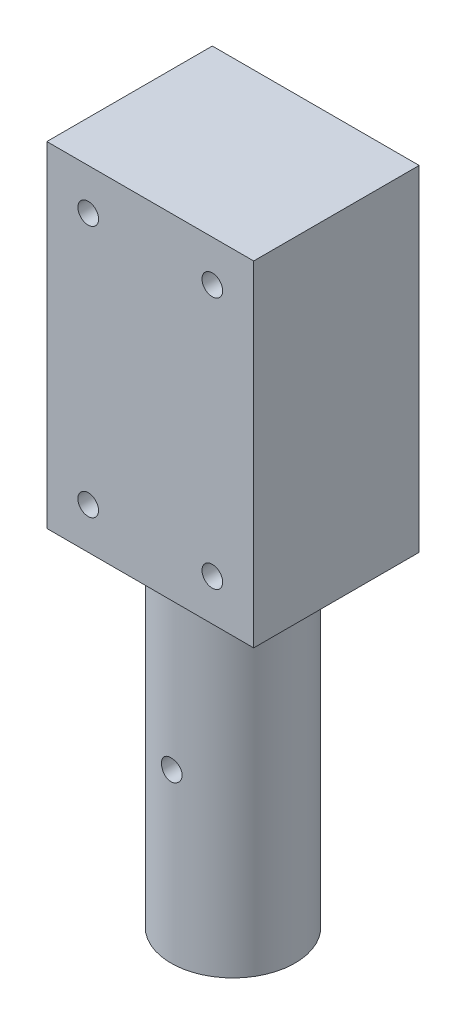
ISO-10303-21;
HEADER;
FILE_DESCRIPTION(('STEP AP214'),'2;1');
FILE_NAME('part.step','',(''),(''),'','','');
FILE_SCHEMA(('AUTOMOTIVE_DESIGN { 1 0 10303 214 1 1 1 1 }'));
ENDSEC;
DATA;
#1=APPLICATION_CONTEXT('core data for automotive mechanical design processes');
#2=APPLICATION_PROTOCOL_DEFINITION('international standard','automotive_design',2000,#1);
#3=PRODUCT_CONTEXT('',#1,'mechanical');
#4=PRODUCT('Part','Part','',(#3));
#5=PRODUCT_RELATED_PRODUCT_CATEGORY('part','',(#4));
#6=PRODUCT_DEFINITION_FORMATION('','',#4);
#7=PRODUCT_DEFINITION_CONTEXT('part definition',#1,'design');
#8=PRODUCT_DEFINITION('design','',#6,#7);
#9=PRODUCT_DEFINITION_SHAPE('','',#8);
#10=(LENGTH_UNIT() NAMED_UNIT(*) SI_UNIT(.MILLI.,.METRE.));
#11=(NAMED_UNIT(*) PLANE_ANGLE_UNIT() SI_UNIT($,.RADIAN.));
#12=(NAMED_UNIT(*) SI_UNIT($,.STERADIAN.) SOLID_ANGLE_UNIT());
#13=UNCERTAINTY_MEASURE_WITH_UNIT(LENGTH_MEASURE(1.E-05),#10,'distance_accuracy_value','');
#14=(GEOMETRIC_REPRESENTATION_CONTEXT(3) GLOBAL_UNCERTAINTY_ASSIGNED_CONTEXT((#13)) GLOBAL_UNIT_ASSIGNED_CONTEXT((#10,
#11,#12)) REPRESENTATION_CONTEXT('',''));
#15=CARTESIAN_POINT('',(0.,0.,0.));
#16=DIRECTION('',(0.,0.,1.));
#17=DIRECTION('',(1.,0.,0.));
#18=AXIS2_PLACEMENT_3D('',#15,#16,#17);
#19=CARTESIAN_POINT('',(0.,81.,0.));
#20=DIRECTION('',(1.,0.,0.));
#21=DIRECTION('',(0.,0.,-1.));
#22=AXIS2_PLACEMENT_3D('',#19,#20,#21);
#23=PLANE('',#22);
#24=DIRECTION('',(0.,0.,1.));
#25=VECTOR('',#24,1.);
#26=CARTESIAN_POINT('',(0.,0.,0.));
#27=LINE('',#26,#25);
#28=CARTESIAN_POINT('',(0.,0.,-40.));
#29=VERTEX_POINT('',#28);
#30=CARTESIAN_POINT('',(0.,0.,0.));
#31=VERTEX_POINT('',#30);
#32=EDGE_CURVE('E183',#29,#31,#27,.T.);
#33=ORIENTED_EDGE('',*,*,#32,.T.);
#34=DIRECTION('',(0.,-1.,0.));
#35=VECTOR('',#34,1.);
#36=CARTESIAN_POINT('',(0.,81.,0.));
#37=LINE('',#36,#35);
#38=CARTESIAN_POINT('',(0.,81.,0.));
#39=VERTEX_POINT('',#38);
#40=EDGE_CURVE('E57',#39,#31,#37,.T.);
#41=ORIENTED_EDGE('',*,*,#40,.F.);
#42=DIRECTION('',(0.,0.,1.));
#43=VECTOR('',#42,1.);
#44=CARTESIAN_POINT('',(0.,81.,0.));
#45=LINE('',#44,#43);
#46=CARTESIAN_POINT('',(0.,81.,-40.));
#47=VERTEX_POINT('',#46);
#48=EDGE_CURVE('E185',#47,#39,#45,.T.);
#49=ORIENTED_EDGE('',*,*,#48,.F.);
#50=DIRECTION('',(0.,-1.,0.));
#51=VECTOR('',#50,1.);
#52=CARTESIAN_POINT('',(0.,81.,-40.));
#53=LINE('',#52,#51);
#54=EDGE_CURVE('E191',#47,#29,#53,.T.);
#55=ORIENTED_EDGE('',*,*,#54,.T.);
#56=EDGE_LOOP('',(#33,#41,#49,#55));
#57=FACE_BOUND('',#56,.T.);
#58=ADVANCED_FACE('F43',(#57),#23,.F.);
#59=CARTESIAN_POINT('',(0.,81.,0.));
#60=DIRECTION('',(0.,0.,-1.));
#61=DIRECTION('',(-1.,0.,0.));
#62=AXIS2_PLACEMENT_3D('',#59,#60,#61);
#63=PLANE('',#62);
#64=CARTESIAN_POINT('',(10.,10.,0.));
#65=DIRECTION('',(0.,0.,1.));
#66=DIRECTION('',(1.,0.,0.));
#67=AXIS2_PLACEMENT_3D('',#64,#65,#66);
#68=CIRCLE('',#67,2.5);
#69=CARTESIAN_POINT('',(12.5,10.,0.));
#70=VERTEX_POINT('',#69);
#71=EDGE_CURVE('E156',#70,#70,#68,.T.);
#72=ORIENTED_EDGE('',*,*,#71,.F.);
#73=EDGE_LOOP('',(#72));
#74=FACE_BOUND('',#73,.T.);
#75=CARTESIAN_POINT('',(40.,10.,0.));
#76=DIRECTION('',(0.,0.,1.));
#77=DIRECTION('',(1.,0.,0.));
#78=AXIS2_PLACEMENT_3D('',#75,#76,#77);
#79=CIRCLE('',#78,2.5);
#80=CARTESIAN_POINT('',(42.5,10.,0.));
#81=VERTEX_POINT('',#80);
#82=EDGE_CURVE('E162',#81,#81,#79,.T.);
#83=ORIENTED_EDGE('',*,*,#82,.F.);
#84=EDGE_LOOP('',(#83));
#85=FACE_BOUND('',#84,.T.);
#86=CARTESIAN_POINT('',(40.,71.,0.));
#87=DIRECTION('',(0.,0.,1.));
#88=DIRECTION('',(1.,0.,0.));
#89=AXIS2_PLACEMENT_3D('',#86,#87,#88);
#90=CIRCLE('',#89,2.5);
#91=CARTESIAN_POINT('',(42.5,71.,0.));
#92=VERTEX_POINT('',#91);
#93=EDGE_CURVE('E168',#92,#92,#90,.T.);
#94=ORIENTED_EDGE('',*,*,#93,.F.);
#95=EDGE_LOOP('',(#94));
#96=FACE_BOUND('',#95,.T.);
#97=CARTESIAN_POINT('',(10.,71.,0.));
#98=DIRECTION('',(0.,0.,1.));
#99=DIRECTION('',(1.,0.,0.));
#100=AXIS2_PLACEMENT_3D('',#97,#98,#99);
#101=CIRCLE('',#100,2.5);
#102=CARTESIAN_POINT('',(12.5,71.,0.));
#103=VERTEX_POINT('',#102);
#104=EDGE_CURVE('E174',#103,#103,#101,.T.);
#105=ORIENTED_EDGE('',*,*,#104,.F.);
#106=EDGE_LOOP('',(#105));
#107=FACE_BOUND('',#106,.T.);
#108=DIRECTION('',(1.,0.,0.));
#109=VECTOR('',#108,1.);
#110=CARTESIAN_POINT('',(0.,0.,0.));
#111=LINE('',#110,#109);
#112=CARTESIAN_POINT('',(50.,0.,0.));
#113=VERTEX_POINT('',#112);
#114=EDGE_CURVE('E194',#31,#113,#111,.T.);
#115=ORIENTED_EDGE('',*,*,#114,.T.);
#116=DIRECTION('',(0.,-1.,0.));
#117=VECTOR('',#116,1.);
#118=CARTESIAN_POINT('',(50.,81.,0.));
#119=LINE('',#118,#117);
#120=CARTESIAN_POINT('',(50.,81.,0.));
#121=VERTEX_POINT('',#120);
#122=EDGE_CURVE('E201',#121,#113,#119,.T.);
#123=ORIENTED_EDGE('',*,*,#122,.F.);
#124=DIRECTION('',(1.,0.,0.));
#125=VECTOR('',#124,1.);
#126=CARTESIAN_POINT('',(0.,81.,0.));
#127=LINE('',#126,#125);
#128=EDGE_CURVE('E98',#39,#121,#127,.T.);
#129=ORIENTED_EDGE('',*,*,#128,.F.);
#130=ORIENTED_EDGE('',*,*,#40,.T.);
#131=EDGE_LOOP('',(#115,#123,#129,#130));
#132=FACE_BOUND('',#131,.T.);
#133=ADVANCED_FACE('F228',(#74,#85,#96,#107,#132),#63,.F.);
#134=CARTESIAN_POINT('',(50.,81.,0.));
#135=DIRECTION('',(-1.,0.,0.));
#136=DIRECTION('',(0.,0.,1.));
#137=AXIS2_PLACEMENT_3D('',#134,#135,#136);
#138=PLANE('',#137);
#139=DIRECTION('',(0.,0.,-1.));
#140=VECTOR('',#139,1.);
#141=CARTESIAN_POINT('',(50.,0.,0.));
#142=LINE('',#141,#140);
#143=CARTESIAN_POINT('',(50.,0.,-40.));
#144=VERTEX_POINT('',#143);
#145=EDGE_CURVE('E84',#113,#144,#142,.T.);
#146=ORIENTED_EDGE('',*,*,#145,.T.);
#147=DIRECTION('',(0.,-1.,0.));
#148=VECTOR('',#147,1.);
#149=CARTESIAN_POINT('',(50.,81.,-40.));
#150=LINE('',#149,#148);
#151=CARTESIAN_POINT('',(50.,81.,-40.));
#152=VERTEX_POINT('',#151);
#153=EDGE_CURVE('E199',#152,#144,#150,.T.);
#154=ORIENTED_EDGE('',*,*,#153,.F.);
#155=DIRECTION('',(0.,0.,-1.));
#156=VECTOR('',#155,1.);
#157=CARTESIAN_POINT('',(50.,81.,0.));
#158=LINE('',#157,#156);
#159=EDGE_CURVE('E188',#121,#152,#158,.T.);
#160=ORIENTED_EDGE('',*,*,#159,.F.);
#161=ORIENTED_EDGE('',*,*,#122,.T.);
#162=EDGE_LOOP('',(#146,#154,#160,#161));
#163=FACE_BOUND('',#162,.T.);
#164=ADVANCED_FACE('F233',(#163),#138,.F.);
#165=CARTESIAN_POINT('',(0.,81.,-40.));
#166=DIRECTION('',(0.,0.,1.));
#167=DIRECTION('',(1.,0.,0.));
#168=AXIS2_PLACEMENT_3D('',#165,#166,#167);
#169=PLANE('',#168);
#170=CARTESIAN_POINT('',(40.,10.,-40.));
#171=DIRECTION('',(0.,0.,-1.));
#172=DIRECTION('',(-1.,0.,0.));
#173=AXIS2_PLACEMENT_3D('',#170,#171,#172);
#174=CIRCLE('',#173,2.5);
#175=CARTESIAN_POINT('',(37.5,10.,-40.));
#176=VERTEX_POINT('',#175);
#177=EDGE_CURVE('E134',#176,#176,#174,.T.);
#178=ORIENTED_EDGE('',*,*,#177,.F.);
#179=EDGE_LOOP('',(#178));
#180=FACE_BOUND('',#179,.T.);
#181=CARTESIAN_POINT('',(10.,10.,-40.));
#182=DIRECTION('',(0.,0.,-1.));
#183=DIRECTION('',(-1.,0.,0.));
#184=AXIS2_PLACEMENT_3D('',#181,#182,#183);
#185=CIRCLE('',#184,2.5);
#186=CARTESIAN_POINT('',(7.50000000000001,10.,-40.));
#187=VERTEX_POINT('',#186);
#188=EDGE_CURVE('E133',#187,#187,#185,.T.);
#189=ORIENTED_EDGE('',*,*,#188,.F.);
#190=EDGE_LOOP('',(#189));
#191=FACE_BOUND('',#190,.T.);
#192=CARTESIAN_POINT('',(10.,71.,-40.));
#193=DIRECTION('',(0.,0.,-1.));
#194=DIRECTION('',(-1.,0.,0.));
#195=AXIS2_PLACEMENT_3D('',#192,#193,#194);
#196=CIRCLE('',#195,2.5);
#197=CARTESIAN_POINT('',(7.50000000000001,71.,-40.));
#198=VERTEX_POINT('',#197);
#199=EDGE_CURVE('E144',#198,#198,#196,.T.);
#200=ORIENTED_EDGE('',*,*,#199,.F.);
#201=EDGE_LOOP('',(#200));
#202=FACE_BOUND('',#201,.T.);
#203=CARTESIAN_POINT('',(40.,71.,-40.));
#204=DIRECTION('',(0.,0.,-1.));
#205=DIRECTION('',(-1.,0.,0.));
#206=AXIS2_PLACEMENT_3D('',#203,#204,#205);
#207=CIRCLE('',#206,2.5);
#208=CARTESIAN_POINT('',(37.5,71.,-40.));
#209=VERTEX_POINT('',#208);
#210=EDGE_CURVE('E150',#209,#209,#207,.T.);
#211=ORIENTED_EDGE('',*,*,#210,.F.);
#212=EDGE_LOOP('',(#211));
#213=FACE_BOUND('',#212,.T.);
#214=DIRECTION('',(-1.,0.,0.));
#215=VECTOR('',#214,1.);
#216=CARTESIAN_POINT('',(0.,0.,-40.));
#217=LINE('',#216,#215);
#218=EDGE_CURVE('E90',#144,#29,#217,.T.);
#219=ORIENTED_EDGE('',*,*,#218,.T.);
#220=ORIENTED_EDGE('',*,*,#54,.F.);
#221=DIRECTION('',(-1.,0.,0.));
#222=VECTOR('',#221,1.);
#223=CARTESIAN_POINT('',(0.,81.,-40.));
#224=LINE('',#223,#222);
#225=EDGE_CURVE('E66',#152,#47,#224,.T.);
#226=ORIENTED_EDGE('',*,*,#225,.F.);
#227=ORIENTED_EDGE('',*,*,#153,.T.);
#228=EDGE_LOOP('',(#219,#220,#226,#227));
#229=FACE_BOUND('',#228,.T.);
#230=ADVANCED_FACE('F242',(#180,#191,#202,#213,#229),#169,.F.);
#231=CARTESIAN_POINT('',(0.,81.,0.));
#232=DIRECTION('',(0.,-1.,0.));
#233=DIRECTION('',(0.,0.,-1.));
#234=AXIS2_PLACEMENT_3D('',#231,#232,#233);
#235=PLANE('',#234);
#236=ORIENTED_EDGE('',*,*,#48,.T.);
#237=ORIENTED_EDGE('',*,*,#128,.T.);
#238=ORIENTED_EDGE('',*,*,#159,.T.);
#239=ORIENTED_EDGE('',*,*,#225,.T.);
#240=EDGE_LOOP('',(#236,#237,#238,#239));
#241=FACE_BOUND('',#240,.T.);
#242=ADVANCED_FACE('F240',(#241),#235,.F.);
#243=CARTESIAN_POINT('',(0.,0.,0.));
#244=DIRECTION('',(0.,-1.,0.));
#245=DIRECTION('',(0.,0.,-1.));
#246=AXIS2_PLACEMENT_3D('',#243,#244,#245);
#247=PLANE('',#246);
#248=CARTESIAN_POINT('',(25.,0.,-20.));
#249=DIRECTION('',(0.,-1.,0.));
#250=DIRECTION('',(0.,0.,-1.));
#251=AXIS2_PLACEMENT_3D('',#248,#249,#250);
#252=CIRCLE('',#251,15.);
#253=CARTESIAN_POINT('',(25.,0.,-35.));
#254=VERTEX_POINT('',#253);
#255=EDGE_CURVE('E11',#254,#254,#252,.T.);
#256=ORIENTED_EDGE('',*,*,#255,.F.);
#257=EDGE_LOOP('',(#256));
#258=FACE_BOUND('',#257,.T.);
#259=ORIENTED_EDGE('',*,*,#32,.F.);
#260=ORIENTED_EDGE('',*,*,#218,.F.);
#261=ORIENTED_EDGE('',*,*,#145,.F.);
#262=ORIENTED_EDGE('',*,*,#114,.F.);
#263=EDGE_LOOP('',(#259,#260,#261,#262));
#264=FACE_BOUND('',#263,.T.);
#265=ADVANCED_FACE('F225',(#258,#264),#247,.T.);
#266=CARTESIAN_POINT('',(25.,-81.,-20.));
#267=DIRECTION('',(0.,1.,0.));
#268=DIRECTION('',(0.,0.,1.));
#269=AXIS2_PLACEMENT_3D('',#266,#267,#268);
#270=CYLINDRICAL_SURFACE('',#269,15.);
#271=CARTESIAN_POINT('',(25.,-43.,-5.00000000000001));
#272=CARTESIAN_POINT('',(24.8606090950418,-42.9999944110522,-5.00000238831177));
#273=CARTESIAN_POINT('',(24.7211421181612,-42.9883027250311,-5.00196322086967));
#274=CARTESIAN_POINT('',(24.446119778327,-42.9418643412347,-5.00959655058613));
#275=CARTESIAN_POINT('',(24.3105681320408,-42.9070964430884,-5.01527246076111));
#276=CARTESIAN_POINT('',(24.0473952527874,-42.8155845514072,-5.02969931763551));
#277=CARTESIAN_POINT('',(23.9197676315681,-42.7588585343594,-5.03844774840808));
#278=CARTESIAN_POINT('',(23.6758581580221,-42.6250877079476,-5.05805772917931));
#279=CARTESIAN_POINT('',(23.5595750101214,-42.548045222517,-5.06891903745567));
#280=CARTESIAN_POINT('',(23.3405273857083,-42.3750449161795,-5.09166682541688));
#281=CARTESIAN_POINT('',(23.237887096465,-42.2789308853639,-5.10356128185144));
#282=CARTESIAN_POINT('',(23.0501115013401,-42.0708520315272,-5.12697373123269));
#283=CARTESIAN_POINT('',(22.964977300609,-41.9588862085434,-5.13849170037333));
#284=CARTESIAN_POINT('',(22.8141328743949,-41.7214290338029,-5.1599243424022));
#285=CARTESIAN_POINT('',(22.748545447139,-41.5958586631953,-5.16982870908365));
#286=CARTESIAN_POINT('',(22.6394416345888,-41.3352904356994,-5.18680210205326));
#287=CARTESIAN_POINT('',(22.5959237584344,-41.2002932163224,-5.19387131985693));
#288=CARTESIAN_POINT('',(22.5325856222152,-40.9260197251435,-5.20429463157245));
#289=CARTESIAN_POINT('',(22.5125509708646,-40.7867942634986,-5.20768231514301));
#290=CARTESIAN_POINT('',(22.4960832747101,-40.5069197231165,-5.21046061063351));
#291=CARTESIAN_POINT('',(22.499648559611,-40.3662707458327,-5.20985150542787));
#292=CARTESIAN_POINT('',(22.5301049016038,-40.0890721387246,-5.20473571136446));
#293=CARTESIAN_POINT('',(22.5567551181102,-39.9524951964548,-5.20026926681084));
#294=CARTESIAN_POINT('',(22.6322468595966,-39.6857786821709,-5.18800504788993));
#295=CARTESIAN_POINT('',(22.6810891456803,-39.5556393311115,-5.18020715926729));
#296=CARTESIAN_POINT('',(22.7998227539061,-39.3047711765591,-5.16211520665901));
#297=CARTESIAN_POINT('',(22.8698140861203,-39.1840905939188,-5.15180932892675));
#298=CARTESIAN_POINT('',(23.0287879824426,-38.9560955994616,-5.12987081584992));
#299=CARTESIAN_POINT('',(23.1177720793457,-38.8487822675451,-5.11823807345715));
#300=CARTESIAN_POINT('',(23.3135177878409,-38.6491739141927,-5.09477972120215));
#301=CARTESIAN_POINT('',(23.4204860361269,-38.5570814814599,-5.08295350768349));
#302=CARTESIAN_POINT('',(23.6484647510183,-38.3921222373347,-5.06057398603277));
#303=CARTESIAN_POINT('',(23.7694753080936,-38.3192555498168,-5.05002068610255));
#304=CARTESIAN_POINT('',(24.0222940838333,-38.1947977728637,-5.03136107107089));
#305=CARTESIAN_POINT('',(24.1541112744353,-38.1432245806687,-5.02325681592554));
#306=CARTESIAN_POINT('',(24.4247016543973,-38.063005784754,-5.01042496987341));
#307=CARTESIAN_POINT('',(24.5634742608205,-38.0343582630263,-5.00569709649527));
#308=CARTESIAN_POINT('',(24.8422900986984,-38.0010786415389,-5.00018870157314));
#309=CARTESIAN_POINT('',(24.982299262849,-37.9961684281944,-4.99936246987216));
#310=CARTESIAN_POINT('',(25.2611397728899,-38.0097613444281,-5.0016252557883));
#311=CARTESIAN_POINT('',(25.399971163892,-38.0282635731337,-5.00471412275882));
#312=CARTESIAN_POINT('',(25.6716561755468,-38.0879248493355,-5.01443173061798));
#313=CARTESIAN_POINT('',(25.8045408683854,-38.1289462083901,-5.0210389519869));
#314=CARTESIAN_POINT('',(26.0615468848604,-38.2323345181995,-5.03705535544642));
#315=CARTESIAN_POINT('',(26.1856677159097,-38.2947026676353,-5.04646469487981));
#316=CARTESIAN_POINT('',(26.422830689469,-38.4396511246968,-5.06715483697593));
#317=CARTESIAN_POINT('',(26.5357652509371,-38.5224051561673,-5.07845144112978));
#318=CARTESIAN_POINT('',(26.7462435855027,-38.7055373153851,-5.101615326081));
#319=CARTESIAN_POINT('',(26.8437862396966,-38.8059167232767,-5.11348264828454));
#320=CARTESIAN_POINT('',(27.021742779658,-39.0226975480714,-5.13659824764155));
#321=CARTESIAN_POINT('',(27.1019687611137,-39.1392541655144,-5.14783883862895));
#322=CARTESIAN_POINT('',(27.241702310295,-39.3843529691385,-5.16828470222116));
#323=CARTESIAN_POINT('',(27.3012105347698,-39.5128947752275,-5.17749003933981));
#324=CARTESIAN_POINT('',(27.3975383314732,-39.7777897328121,-5.19276546302296));
#325=CARTESIAN_POINT('',(27.4344514325479,-39.9141080950305,-5.19884845688936));
#326=CARTESIAN_POINT('',(27.4848354537783,-40.1911201292218,-5.2072228316474));
#327=CARTESIAN_POINT('',(27.4983084119462,-40.3318134197321,-5.20951454217279));
#328=CARTESIAN_POINT('',(27.5013728660474,-40.6117051659624,-5.21003266915989));
#329=CARTESIAN_POINT('',(27.4912601361252,-40.7509003785753,-5.20830943494351));
#330=CARTESIAN_POINT('',(27.4480798389568,-41.0255792480508,-5.20110218546272));
#331=CARTESIAN_POINT('',(27.4150123461125,-41.1610629169419,-5.19561818238787));
#332=CARTESIAN_POINT('',(27.3269744895949,-41.4243584372926,-5.18152643718282));
#333=CARTESIAN_POINT('',(27.2720295906004,-41.552179010056,-5.17292232780331));
#334=CARTESIAN_POINT('',(27.1418270039159,-41.7968356691948,-5.15355631077793));
#335=CARTESIAN_POINT('',(27.0665683087486,-41.9136712103721,-5.14279429611601));
#336=CARTESIAN_POINT('',(26.8968188843722,-42.1345355831078,-5.12016545954379));
#337=CARTESIAN_POINT('',(26.8021105635936,-42.2383960167003,-5.10828704423698));
#338=CARTESIAN_POINT('',(26.5966090313802,-42.4288516044749,-5.0848562763916));
#339=CARTESIAN_POINT('',(26.4858121129126,-42.5154427686382,-5.07330399973454));
#340=CARTESIAN_POINT('',(26.2503691696403,-42.6694482681999,-5.0517347035778));
#341=CARTESIAN_POINT('',(26.1256327875328,-42.7367260393129,-5.04172883746896));
#342=CARTESIAN_POINT('',(25.866513069379,-42.8492694846099,-5.02448832398225));
#343=CARTESIAN_POINT('',(25.73213949483,-42.8945570810797,-5.01725091822519));
#344=CARTESIAN_POINT('',(25.4977033100454,-42.9520052741267,-5.00794209167045));
#345=CARTESIAN_POINT('',(25.3990588302985,-42.969974469616,-5.00497972726642));
#346=CARTESIAN_POINT('',(25.2002893103198,-42.9939737378448,-5.0010078401388));
#347=CARTESIAN_POINT('',(25.1001642956085,-43.0000040161374,-4.99999828379359));
#348=CARTESIAN_POINT('',(25.,-43.,-5.00000000000001));
#349=B_SPLINE_CURVE_WITH_KNOTS('',3,(#271,#272,#273,#274,#275,#276,#277,#278,#279,#280,#281,
#282,#283,#284,#285,#286,#287,#288,#289,#290,#291,#292,#293,#294,#295,#296,#297,#298,#299,#300,
#301,#302,#303,#304,#305,#306,#307,#308,#309,#310,#311,#312,#313,#314,#315,#316,#317,#318,#319,
#320,#321,#322,#323,#324,#325,#326,#327,#328,#329,#330,#331,#332,#333,#334,#335,#336,#337,#338,
#339,#340,#341,#342,#343,#344,#345,#346,#347,#348),.UNSPECIFIED.,.T.,.F.,(4,2,2,2,2,2,2,2,2,2,2,
2,2,2,2,2,2,2,2,2,2,2,2,2,2,2,2,2,2,2,2,2,2,2,2,2,2,2,4),(0.,0.417806584938507,0.83599754569542,
1.25384686702527,1.67164841267479,2.09302491062332,2.51442800169857,2.9384252082384,
3.36239376876181,3.78246077103422,4.20249804320886,4.61820521760409,5.03392665025381,
5.45164556632558,5.86939820680573,6.29232769911326,6.71525991635847,7.13854688915903,
7.56179844521149,7.98007883491396,8.39834313035859,8.81407807006415,9.22983635826066,
9.64926825627023,10.0687306305428,10.4925382200762,10.9163323737594,11.3383602234177,
11.7603513778662,12.177079095227,12.5938054618813,13.0100481822622,13.4263115502934,
13.8475138419339,14.2688133387897,14.693022316072,15.1168075213007,15.4170424816402,
15.7172722727697),.UNSPECIFIED.);
#350=CARTESIAN_POINT('',(25.,-43.,-5.00000000000001));
#351=VERTEX_POINT('',#350);
#352=EDGE_CURVE('E46',#351,#351,#349,.T.);
#353=ORIENTED_EDGE('',*,*,#352,.T.);
#354=EDGE_LOOP('',(#353));
#355=FACE_BOUND('',#354,.T.);
#356=CARTESIAN_POINT('',(27.5,-40.5,-34.790199457749));
#357=CARTESIAN_POINT('',(27.4999943984198,-40.3606242518382,-34.790201973666));
#358=CARTESIAN_POINT('',(27.4883051690283,-40.2211723939285,-34.7921909238523));
#359=CARTESIAN_POINT('',(27.4418774280664,-39.9461814567368,-34.7999245720004));
#360=CARTESIAN_POINT('',(27.4071176603086,-39.8106461062419,-34.8056727334637));
#361=CARTESIAN_POINT('',(27.3156295436705,-39.5475077166584,-34.8202560936731));
#362=CARTESIAN_POINT('',(27.258919554932,-39.4198981513378,-34.8290887118401));
#363=CARTESIAN_POINT('',(27.1251864968895,-39.1760190452822,-34.8488427210228));
#364=CARTESIAN_POINT('',(27.0481657135013,-39.0597482304227,-34.8597638769423));
#365=CARTESIAN_POINT('',(26.8751875269665,-38.8406871502554,-34.8825847115588));
#366=CARTESIAN_POINT('',(26.7790690489323,-38.7380248686138,-34.8944921732795));
#367=CARTESIAN_POINT('',(26.5709720046953,-38.5502066931382,-34.9178748066858));
#368=CARTESIAN_POINT('',(26.45899249915,-38.4650518368846,-34.9293499527173));
#369=CARTESIAN_POINT('',(26.2215228699484,-38.3141854327807,-34.9506573698271));
#370=CARTESIAN_POINT('',(26.0959560814567,-38.2485929922682,-34.9604794243234));
#371=CARTESIAN_POINT('',(25.8353956217239,-38.1394789294694,-34.9772873695709));
#372=CARTESIAN_POINT('',(25.7004025640782,-38.0959558721151,-34.9842734447266));
#373=CARTESIAN_POINT('',(25.4261437263442,-38.0326074650161,-34.994567347244));
#374=CARTESIAN_POINT('',(25.2869288866793,-38.0125670839953,-34.9979085311091));
#375=CARTESIAN_POINT('',(25.0070752855258,-37.9960842458474,-35.0006507934278));
#376=CARTESIAN_POINT('',(24.8664366214711,-37.9996401847528,-35.0000521396931));
#377=CARTESIAN_POINT('',(24.5891978149211,-38.0300813515282,-34.9950085843139));
#378=CARTESIAN_POINT('',(24.4525714692999,-38.0567351634092,-34.990601836924));
#379=CARTESIAN_POINT('',(24.1857580203882,-38.1322510742465,-34.9784797877164));
#380=CARTESIAN_POINT('',(24.0555711133485,-38.1811138495895,-34.9707643851321));
#381=CARTESIAN_POINT('',(23.8046438522174,-38.2998906403153,-34.9528269851196));
#382=CARTESIAN_POINT('',(23.683949476981,-38.3699000120824,-34.9425936732688));
#383=CARTESIAN_POINT('',(23.4559344701534,-38.528912822635,-34.920757380715));
#384=CARTESIAN_POINT('',(23.3486149220841,-38.6179177987108,-34.9091542891913));
#385=CARTESIAN_POINT('',(23.1490287265533,-38.8136788066193,-34.885702682326));
#386=CARTESIAN_POINT('',(23.0569604977468,-38.920637094901,-34.8738528973104));
#387=CARTESIAN_POINT('',(22.8920454115519,-39.1485870902158,-34.8513795978481));
#388=CARTESIAN_POINT('',(22.8191987314676,-39.2695789266828,-34.8407560947132));
#389=CARTESIAN_POINT('',(22.6947555655117,-39.5223916418775,-34.8219375456182));
#390=CARTESIAN_POINT('',(22.6431829727208,-39.6542244980921,-34.813745233026));
#391=CARTESIAN_POINT('',(22.5629701291844,-39.9248490723075,-34.8007618868988));
#392=CARTESIAN_POINT('',(22.534327859232,-40.0636401764324,-34.7959705538832));
#393=CARTESIAN_POINT('',(22.5010681151207,-40.3424661561621,-34.7903895942212));
#394=CARTESIAN_POINT('',(22.4961677920876,-40.4824663797021,-34.7895528575867));
#395=CARTESIAN_POINT('',(22.5097772973175,-40.7612866716908,-34.7918503478236));
#396=CARTESIAN_POINT('',(22.5282862213753,-40.900106785514,-34.7949844213185));
#397=CARTESIAN_POINT('',(22.5879476650719,-41.1717277591909,-34.8048268745502));
#398=CARTESIAN_POINT('',(22.6289562093536,-41.304561139878,-34.8115125191835));
#399=CARTESIAN_POINT('',(22.7323018098077,-41.5614701662795,-34.827685730055));
#400=CARTESIAN_POINT('',(22.7946401418991,-41.6855452875509,-34.8371734639058));
#401=CARTESIAN_POINT('',(22.9395433267708,-41.9226745944061,-34.8579912839739));
#402=CARTESIAN_POINT('',(23.0222894358406,-42.0356165727561,-34.8693375560035));
#403=CARTESIAN_POINT('',(23.205410534292,-42.246113532695,-34.8925466667987));
#404=CARTESIAN_POINT('',(23.305786763616,-42.3436674311097,-34.9044095418533));
#405=CARTESIAN_POINT('',(23.5225719296712,-42.5216518927287,-34.9274642211826));
#406=CARTESIAN_POINT('',(23.6391367466138,-42.6018938262845,-34.9386477634467));
#407=CARTESIAN_POINT('',(23.8842565520507,-42.7416553270049,-34.9589511243294));
#408=CARTESIAN_POINT('',(24.0128111525294,-42.8011755644738,-34.9680710096998));
#409=CARTESIAN_POINT('',(24.2777009484987,-42.8975105839549,-34.9831835816958));
#410=CARTESIAN_POINT('',(24.4139994373974,-42.9344240757349,-34.9891898456762));
#411=CARTESIAN_POINT('',(24.6909692651258,-42.9848155989638,-34.9974558316928));
#412=CARTESIAN_POINT('',(24.8316402431784,-42.9982955587324,-34.9997158620019));
#413=CARTESIAN_POINT('',(25.1115412757737,-43.0013818823122,-35.0002303788781));
#414=CARTESIAN_POINT('',(25.2507681606027,-42.9912752539411,-34.9985330202419));
#415=CARTESIAN_POINT('',(25.5255119743147,-42.9480960777306,-34.9914217838733));
#416=CARTESIAN_POINT('',(25.6610289239675,-42.9150236584903,-34.9860079269518));
#417=CARTESIAN_POINT('',(25.9243964459185,-42.8269618344563,-34.972069888274));
#418=CARTESIAN_POINT('',(26.0522553721538,-42.7719968317899,-34.9635491704088));
#419=CARTESIAN_POINT('',(26.2969804529822,-42.6417420637694,-34.9443275687803));
#420=CARTESIAN_POINT('',(26.4138460861182,-42.5664513349375,-34.9336265816741));
#421=CARTESIAN_POINT('',(26.6347129455264,-42.3966649075395,-34.9110762961641));
#422=CARTESIAN_POINT('',(26.7385514306028,-42.3019590452487,-34.8992152454112));
#423=CARTESIAN_POINT('',(26.9289638759509,-42.0964716920962,-34.8757630331437));
#424=CARTESIAN_POINT('',(27.0155337867119,-41.9856864410875,-34.8641719354951));
#425=CARTESIAN_POINT('',(27.1695142709109,-41.7502546775104,-34.8424834353391));
#426=CARTESIAN_POINT('',(27.2367849890577,-41.6255156602345,-34.8323971784578));
#427=CARTESIAN_POINT('',(27.3493145364043,-41.3663907641619,-34.8149921009131));
#428=CARTESIAN_POINT('',(27.3945953552231,-41.2320146773226,-34.8076705172488));
#429=CARTESIAN_POINT('',(27.4520260531274,-40.9975962305126,-34.7982474485649));
#430=CARTESIAN_POINT('',(27.4699874176714,-40.8989731920374,-34.7952462341947));
#431=CARTESIAN_POINT('',(27.4939762951813,-40.7002465151631,-34.7912213528807));
#432=CARTESIAN_POINT('',(27.5000040247928,-40.6001429036758,-34.7901976500369));
#433=CARTESIAN_POINT('',(27.5,-40.5,-34.790199457749));
#434=B_SPLINE_CURVE_WITH_KNOTS('',3,(#356,#357,#358,#359,#360,#361,#362,#363,#364,#365,#366,
#367,#368,#369,#370,#371,#372,#373,#374,#375,#376,#377,#378,#379,#380,#381,#382,#383,#384,#385,
#386,#387,#388,#389,#390,#391,#392,#393,#394,#395,#396,#397,#398,#399,#400,#401,#402,#403,#404,
#405,#406,#407,#408,#409,#410,#411,#412,#413,#414,#415,#416,#417,#418,#419,#420,#421,#422,#423,
#424,#425,#426,#427,#428,#429,#430,#431,#432,#433),.UNSPECIFIED.,.T.,.F.,(4,2,2,2,2,2,2,2,2,2,2,
2,2,2,2,2,2,2,2,2,2,2,2,2,2,2,2,2,2,2,2,2,2,2,2,2,2,2,4),(0.,0.417761038927736,0.83590751996297,
1.25370499787518,1.67145547405273,2.09289159155715,2.51435267834447,2.93832980111435,
3.36227935111113,3.78231567472565,4.20232344652692,4.61817121164668,5.03403164249533,
5.45179604139425,5.86959426226764,6.29246123462123,6.71533210746018,7.13867662498603,
7.56198385938077,7.9802354242041,8.39847083413976,8.81406064635491,9.22967532293574,
9.64912342762701,10.0686010443069,10.4924411303538,10.916267504767,11.3382298441765,
11.7601574591235,12.1769777626592,12.5937957321882,13.0101503983246,13.4265248039233,
13.8476699746325,14.2689137888181,14.6931372761832,15.1169356674445,15.4171067054376,
15.7172722940182),.UNSPECIFIED.);
#435=CARTESIAN_POINT('',(27.5,-40.5,-34.790199457749));
#436=VERTEX_POINT('',#435);
#437=EDGE_CURVE('E180',#436,#436,#434,.T.);
#438=ORIENTED_EDGE('',*,*,#437,.T.);
#439=EDGE_LOOP('',(#438));
#440=FACE_BOUND('',#439,.T.);
#441=CARTESIAN_POINT('',(25.,-81.,-20.));
#442=DIRECTION('',(0.,-1.,0.));
#443=DIRECTION('',(0.,0.,-1.));
#444=AXIS2_PLACEMENT_3D('',#441,#442,#443);
#445=CIRCLE('',#444,15.);
#446=CARTESIAN_POINT('',(25.,-81.,-35.));
#447=VERTEX_POINT('',#446);
#448=EDGE_CURVE('E181',#447,#447,#445,.T.);
#449=ORIENTED_EDGE('',*,*,#448,.F.);
#450=EDGE_LOOP('',(#449));
#451=FACE_BOUND('',#450,.T.);
#452=ORIENTED_EDGE('',*,*,#255,.T.);
#453=EDGE_LOOP('',(#452));
#454=FACE_BOUND('',#453,.T.);
#455=ADVANCED_FACE('F207',(#355,#440,#451,#454),#270,.T.);
#456=CARTESIAN_POINT('',(25.,-81.,-20.));
#457=DIRECTION('',(0.,-1.,0.));
#458=DIRECTION('',(0.,0.,-1.));
#459=AXIS2_PLACEMENT_3D('',#456,#457,#458);
#460=PLANE('',#459);
#461=ORIENTED_EDGE('',*,*,#448,.T.);
#462=EDGE_LOOP('',(#461));
#463=FACE_BOUND('',#462,.T.);
#464=ADVANCED_FACE('F216',(#463),#460,.T.);
#465=CARTESIAN_POINT('',(25.,-40.5,-40.));
#466=DIRECTION('',(0.,0.,1.));
#467=DIRECTION('',(1.,0.,0.));
#468=AXIS2_PLACEMENT_3D('',#465,#466,#467);
#469=CYLINDRICAL_SURFACE('',#468,2.5);
#470=ORIENTED_EDGE('',*,*,#437,.F.);
#471=EDGE_LOOP('',(#470));
#472=FACE_BOUND('',#471,.T.);
#473=ORIENTED_EDGE('',*,*,#352,.F.);
#474=EDGE_LOOP('',(#473));
#475=FACE_BOUND('',#474,.T.);
#476=ADVANCED_FACE('F211',(#472,#475),#469,.F.);
#477=CARTESIAN_POINT('',(10.,71.,-13.4978484524311));
#478=DIRECTION('',(0.,0.,1.));
#479=DIRECTION('',(1.,0.,0.));
#480=AXIS2_PLACEMENT_3D('',#477,#478,#479);
#481=CONICAL_SURFACE('',#480,2.5,1.02974425867665);
#482=CARTESIAN_POINT('',(10.,71.,-15.));
#483=VERTEX_POINT('',#482);
#484=VERTEX_LOOP('',#483);
#485=FACE_BOUND('',#484,.T.);
#486=CARTESIAN_POINT('',(10.,71.,-13.4978484524311));
#487=DIRECTION('',(0.,0.,1.));
#488=DIRECTION('',(1.,0.,0.));
#489=AXIS2_PLACEMENT_3D('',#486,#487,#488);
#490=CIRCLE('',#489,2.5);
#491=CARTESIAN_POINT('',(12.5,71.,-13.4978484524311));
#492=VERTEX_POINT('',#491);
#493=EDGE_CURVE('E177',#492,#492,#490,.T.);
#494=ORIENTED_EDGE('',*,*,#493,.T.);
#495=EDGE_LOOP('',(#494));
#496=FACE_BOUND('',#495,.T.);
#497=ADVANCED_FACE('F215',(#485,#496),#481,.F.);
#498=CARTESIAN_POINT('',(10.,71.,0.));
#499=DIRECTION('',(0.,0.,1.));
#500=DIRECTION('',(1.,0.,0.));
#501=AXIS2_PLACEMENT_3D('',#498,#499,#500);
#502=CYLINDRICAL_SURFACE('',#501,2.5);
#503=ORIENTED_EDGE('',*,*,#493,.F.);
#504=EDGE_LOOP('',(#503));
#505=FACE_BOUND('',#504,.T.);
#506=ORIENTED_EDGE('',*,*,#104,.T.);
#507=EDGE_LOOP('',(#506));
#508=FACE_BOUND('',#507,.T.);
#509=ADVANCED_FACE('F379',(#505,#508),#502,.F.);
#510=CARTESIAN_POINT('',(40.,71.,-13.4978484524311));
#511=DIRECTION('',(0.,0.,1.));
#512=DIRECTION('',(1.,0.,0.));
#513=AXIS2_PLACEMENT_3D('',#510,#511,#512);
#514=CONICAL_SURFACE('',#513,2.5,1.02974425867665);
#515=CARTESIAN_POINT('',(40.,71.,-15.));
#516=VERTEX_POINT('',#515);
#517=VERTEX_LOOP('',#516);
#518=FACE_BOUND('',#517,.T.);
#519=CARTESIAN_POINT('',(40.,71.,-13.4978484524311));
#520=DIRECTION('',(0.,0.,1.));
#521=DIRECTION('',(1.,0.,0.));
#522=AXIS2_PLACEMENT_3D('',#519,#520,#521);
#523=CIRCLE('',#522,2.5);
#524=CARTESIAN_POINT('',(42.5,71.,-13.4978484524311));
#525=VERTEX_POINT('',#524);
#526=EDGE_CURVE('E171',#525,#525,#523,.T.);
#527=ORIENTED_EDGE('',*,*,#526,.T.);
#528=EDGE_LOOP('',(#527));
#529=FACE_BOUND('',#528,.T.);
#530=ADVANCED_FACE('F370',(#518,#529),#514,.F.);
#531=CARTESIAN_POINT('',(40.,71.,0.));
#532=DIRECTION('',(0.,0.,1.));
#533=DIRECTION('',(1.,0.,0.));
#534=AXIS2_PLACEMENT_3D('',#531,#532,#533);
#535=CYLINDRICAL_SURFACE('',#534,2.5);
#536=ORIENTED_EDGE('',*,*,#526,.F.);
#537=EDGE_LOOP('',(#536));
#538=FACE_BOUND('',#537,.T.);
#539=ORIENTED_EDGE('',*,*,#93,.T.);
#540=EDGE_LOOP('',(#539));
#541=FACE_BOUND('',#540,.T.);
#542=ADVANCED_FACE('F362',(#538,#541),#535,.F.);
#543=CARTESIAN_POINT('',(40.,10.,-13.4978484524311));
#544=DIRECTION('',(0.,0.,1.));
#545=DIRECTION('',(1.,0.,0.));
#546=AXIS2_PLACEMENT_3D('',#543,#544,#545);
#547=CONICAL_SURFACE('',#546,2.5,1.02974425867665);
#548=CARTESIAN_POINT('',(40.,10.,-15.));
#549=VERTEX_POINT('',#548);
#550=VERTEX_LOOP('',#549);
#551=FACE_BOUND('',#550,.T.);
#552=CARTESIAN_POINT('',(40.,10.,-13.4978484524311));
#553=DIRECTION('',(0.,0.,1.));
#554=DIRECTION('',(1.,0.,0.));
#555=AXIS2_PLACEMENT_3D('',#552,#553,#554);
#556=CIRCLE('',#555,2.5);
#557=CARTESIAN_POINT('',(42.5,10.,-13.4978484524311));
#558=VERTEX_POINT('',#557);
#559=EDGE_CURVE('E165',#558,#558,#556,.T.);
#560=ORIENTED_EDGE('',*,*,#559,.T.);
#561=EDGE_LOOP('',(#560));
#562=FACE_BOUND('',#561,.T.);
#563=ADVANCED_FACE('F353',(#551,#562),#547,.F.);
#564=CARTESIAN_POINT('',(40.,10.,0.));
#565=DIRECTION('',(0.,0.,1.));
#566=DIRECTION('',(1.,0.,0.));
#567=AXIS2_PLACEMENT_3D('',#564,#565,#566);
#568=CYLINDRICAL_SURFACE('',#567,2.5);
#569=ORIENTED_EDGE('',*,*,#559,.F.);
#570=EDGE_LOOP('',(#569));
#571=FACE_BOUND('',#570,.T.);
#572=ORIENTED_EDGE('',*,*,#82,.T.);
#573=EDGE_LOOP('',(#572));
#574=FACE_BOUND('',#573,.T.);
#575=ADVANCED_FACE('F344',(#571,#574),#568,.F.);
#576=CARTESIAN_POINT('',(10.,10.,-13.4978484524311));
#577=DIRECTION('',(0.,0.,1.));
#578=DIRECTION('',(1.,0.,0.));
#579=AXIS2_PLACEMENT_3D('',#576,#577,#578);
#580=CONICAL_SURFACE('',#579,2.5,1.02974425867665);
#581=CARTESIAN_POINT('',(10.,10.,-15.));
#582=VERTEX_POINT('',#581);
#583=VERTEX_LOOP('',#582);
#584=FACE_BOUND('',#583,.T.);
#585=CARTESIAN_POINT('',(10.,10.,-13.4978484524311));
#586=DIRECTION('',(0.,0.,1.));
#587=DIRECTION('',(1.,0.,0.));
#588=AXIS2_PLACEMENT_3D('',#585,#586,#587);
#589=CIRCLE('',#588,2.5);
#590=CARTESIAN_POINT('',(12.5,10.,-13.4978484524311));
#591=VERTEX_POINT('',#590);
#592=EDGE_CURVE('E159',#591,#591,#589,.T.);
#593=ORIENTED_EDGE('',*,*,#592,.T.);
#594=EDGE_LOOP('',(#593));
#595=FACE_BOUND('',#594,.T.);
#596=ADVANCED_FACE('F335',(#584,#595),#580,.F.);
#597=CARTESIAN_POINT('',(10.,10.,0.));
#598=DIRECTION('',(0.,0.,1.));
#599=DIRECTION('',(1.,0.,0.));
#600=AXIS2_PLACEMENT_3D('',#597,#598,#599);
#601=CYLINDRICAL_SURFACE('',#600,2.5);
#602=ORIENTED_EDGE('',*,*,#592,.F.);
#603=EDGE_LOOP('',(#602));
#604=FACE_BOUND('',#603,.T.);
#605=ORIENTED_EDGE('',*,*,#71,.T.);
#606=EDGE_LOOP('',(#605));
#607=FACE_BOUND('',#606,.T.);
#608=ADVANCED_FACE('F327',(#604,#607),#601,.F.);
#609=CARTESIAN_POINT('',(40.,71.,-26.5021515475689));
#610=DIRECTION('',(0.,0.,-1.));
#611=DIRECTION('',(-1.,0.,0.));
#612=AXIS2_PLACEMENT_3D('',#609,#610,#611);
#613=CONICAL_SURFACE('',#612,2.5,1.02974425867665);
#614=CARTESIAN_POINT('',(40.,71.,-25.));
#615=VERTEX_POINT('',#614);
#616=VERTEX_LOOP('',#615);
#617=FACE_BOUND('',#616,.T.);
#618=CARTESIAN_POINT('',(40.,71.,-26.5021515475689));
#619=DIRECTION('',(0.,0.,-1.));
#620=DIRECTION('',(-1.,0.,0.));
#621=AXIS2_PLACEMENT_3D('',#618,#619,#620);
#622=CIRCLE('',#621,2.5);
#623=CARTESIAN_POINT('',(37.5,71.,-26.5021515475689));
#624=VERTEX_POINT('',#623);
#625=EDGE_CURVE('E153',#624,#624,#622,.T.);
#626=ORIENTED_EDGE('',*,*,#625,.T.);
#627=EDGE_LOOP('',(#626));
#628=FACE_BOUND('',#627,.T.);
#629=ADVANCED_FACE('F318',(#617,#628),#613,.F.);
#630=CARTESIAN_POINT('',(40.,71.,-40.));
#631=DIRECTION('',(0.,0.,-1.));
#632=DIRECTION('',(-1.,0.,0.));
#633=AXIS2_PLACEMENT_3D('',#630,#631,#632);
#634=CYLINDRICAL_SURFACE('',#633,2.5);
#635=ORIENTED_EDGE('',*,*,#625,.F.);
#636=EDGE_LOOP('',(#635));
#637=FACE_BOUND('',#636,.T.);
#638=ORIENTED_EDGE('',*,*,#210,.T.);
#639=EDGE_LOOP('',(#638));
#640=FACE_BOUND('',#639,.T.);
#641=ADVANCED_FACE('F309',(#637,#640),#634,.F.);
#642=CARTESIAN_POINT('',(10.,71.,-26.5021515475689));
#643=DIRECTION('',(0.,0.,-1.));
#644=DIRECTION('',(-1.,0.,0.));
#645=AXIS2_PLACEMENT_3D('',#642,#643,#644);
#646=CONICAL_SURFACE('',#645,2.5,1.02974425867665);
#647=CARTESIAN_POINT('',(10.,71.,-25.));
#648=VERTEX_POINT('',#647);
#649=VERTEX_LOOP('',#648);
#650=FACE_BOUND('',#649,.T.);
#651=CARTESIAN_POINT('',(10.,71.,-26.5021515475689));
#652=DIRECTION('',(0.,0.,-1.));
#653=DIRECTION('',(-1.,0.,0.));
#654=AXIS2_PLACEMENT_3D('',#651,#652,#653);
#655=CIRCLE('',#654,2.5);
#656=CARTESIAN_POINT('',(7.50000000000001,71.,-26.5021515475689));
#657=VERTEX_POINT('',#656);
#658=EDGE_CURVE('E147',#657,#657,#655,.T.);
#659=ORIENTED_EDGE('',*,*,#658,.T.);
#660=EDGE_LOOP('',(#659));
#661=FACE_BOUND('',#660,.T.);
#662=ADVANCED_FACE('F300',(#650,#661),#646,.F.);
#663=CARTESIAN_POINT('',(10.,71.,-40.));
#664=DIRECTION('',(0.,0.,-1.));
#665=DIRECTION('',(-1.,0.,0.));
#666=AXIS2_PLACEMENT_3D('',#663,#664,#665);
#667=CYLINDRICAL_SURFACE('',#666,2.5);
#668=ORIENTED_EDGE('',*,*,#658,.F.);
#669=EDGE_LOOP('',(#668));
#670=FACE_BOUND('',#669,.T.);
#671=ORIENTED_EDGE('',*,*,#199,.T.);
#672=EDGE_LOOP('',(#671));
#673=FACE_BOUND('',#672,.T.);
#674=ADVANCED_FACE('F291',(#670,#673),#667,.F.);
#675=CARTESIAN_POINT('',(10.,10.,-26.5021515475689));
#676=DIRECTION('',(0.,0.,-1.));
#677=DIRECTION('',(-1.,0.,0.));
#678=AXIS2_PLACEMENT_3D('',#675,#676,#677);
#679=CONICAL_SURFACE('',#678,2.5,1.02974425867665);
#680=CARTESIAN_POINT('',(10.,10.,-25.));
#681=VERTEX_POINT('',#680);
#682=VERTEX_LOOP('',#681);
#683=FACE_BOUND('',#682,.T.);
#684=CARTESIAN_POINT('',(10.,10.,-26.5021515475689));
#685=DIRECTION('',(0.,0.,-1.));
#686=DIRECTION('',(-1.,0.,0.));
#687=AXIS2_PLACEMENT_3D('',#684,#685,#686);
#688=CIRCLE('',#687,2.5);
#689=CARTESIAN_POINT('',(7.50000000000001,10.,-26.5021515475689));
#690=VERTEX_POINT('',#689);
#691=EDGE_CURVE('E137',#690,#690,#688,.T.);
#692=ORIENTED_EDGE('',*,*,#691,.T.);
#693=EDGE_LOOP('',(#692));
#694=FACE_BOUND('',#693,.T.);
#695=ADVANCED_FACE('F284',(#683,#694),#679,.F.);
#696=CARTESIAN_POINT('',(10.,10.,-40.));
#697=DIRECTION('',(0.,0.,-1.));
#698=DIRECTION('',(-1.,0.,0.));
#699=AXIS2_PLACEMENT_3D('',#696,#697,#698);
#700=CYLINDRICAL_SURFACE('',#699,2.5);
#701=ORIENTED_EDGE('',*,*,#691,.F.);
#702=EDGE_LOOP('',(#701));
#703=FACE_BOUND('',#702,.T.);
#704=ORIENTED_EDGE('',*,*,#188,.T.);
#705=EDGE_LOOP('',(#704));
#706=FACE_BOUND('',#705,.T.);
#707=ADVANCED_FACE('F127',(#703,#706),#700,.F.);
#708=CARTESIAN_POINT('',(40.,10.,-26.5021515475689));
#709=DIRECTION('',(0.,0.,-1.));
#710=DIRECTION('',(-1.,0.,0.));
#711=AXIS2_PLACEMENT_3D('',#708,#709,#710);
#712=CONICAL_SURFACE('',#711,2.5,1.02974425867665);
#713=CARTESIAN_POINT('',(40.,10.,-25.));
#714=VERTEX_POINT('',#713);
#715=VERTEX_LOOP('',#714);
#716=FACE_BOUND('',#715,.T.);
#717=CARTESIAN_POINT('',(40.,10.,-26.5021515475689));
#718=DIRECTION('',(0.,0.,-1.));
#719=DIRECTION('',(-1.,0.,0.));
#720=AXIS2_PLACEMENT_3D('',#717,#718,#719);
#721=CIRCLE('',#720,2.5);
#722=CARTESIAN_POINT('',(37.5,10.,-26.5021515475689));
#723=VERTEX_POINT('',#722);
#724=EDGE_CURVE('E131',#723,#723,#721,.T.);
#725=ORIENTED_EDGE('',*,*,#724,.T.);
#726=EDGE_LOOP('',(#725));
#727=FACE_BOUND('',#726,.T.);
#728=ADVANCED_FACE('F123',(#716,#727),#712,.F.);
#729=CARTESIAN_POINT('',(40.,10.,-40.));
#730=DIRECTION('',(0.,0.,-1.));
#731=DIRECTION('',(-1.,0.,0.));
#732=AXIS2_PLACEMENT_3D('',#729,#730,#731);
#733=CYLINDRICAL_SURFACE('',#732,2.5);
#734=ORIENTED_EDGE('',*,*,#724,.F.);
#735=EDGE_LOOP('',(#734));
#736=FACE_BOUND('',#735,.T.);
#737=ORIENTED_EDGE('',*,*,#177,.T.);
#738=EDGE_LOOP('',(#737));
#739=FACE_BOUND('',#738,.T.);
#740=ADVANCED_FACE('F126',(#736,#739),#733,.F.);
#741=CLOSED_SHELL('',(#58,#133,#164,#230,#242,#265,#455,#464,#476,#497,#509,#530,#542,#563,#575,
#596,#608,#629,#641,#662,#674,#695,#707,#728,#740));
#742=MANIFOLD_SOLID_BREP('B2',#741);
#743=ADVANCED_BREP_SHAPE_REPRESENTATION('',(#18,#742),#14);
#744=SHAPE_DEFINITION_REPRESENTATION(#9,#743);
ENDSEC;
END-ISO-10303-21;
